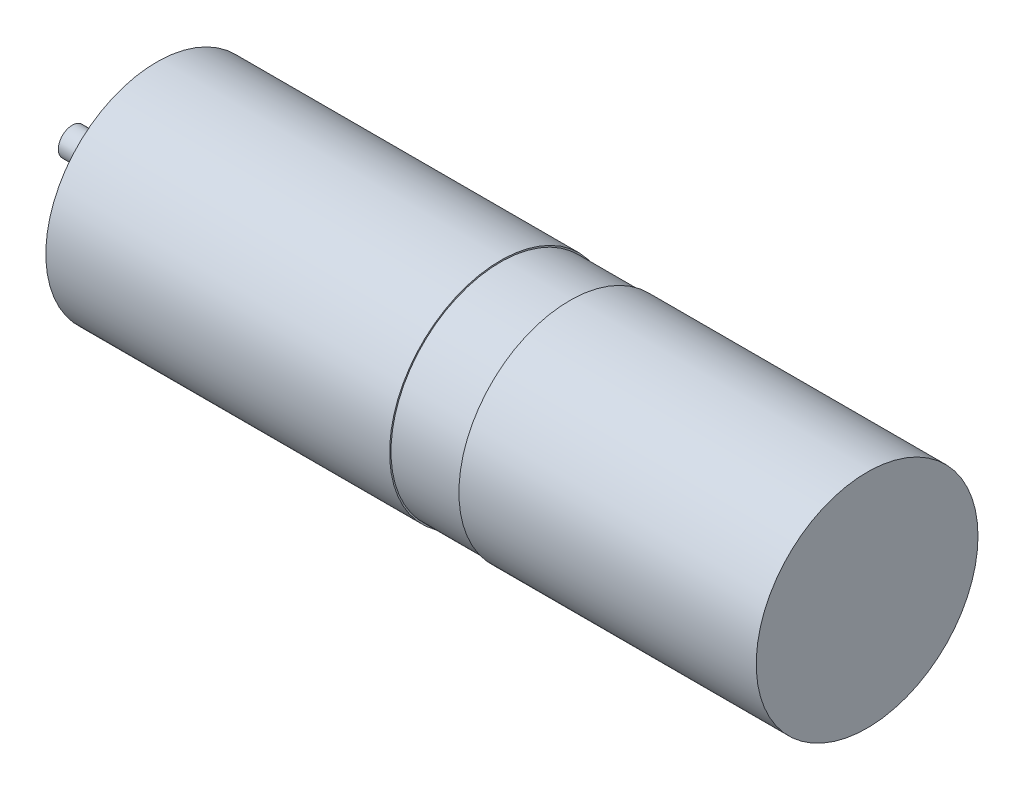
ISO-10303-21;
HEADER;
FILE_DESCRIPTION(('STEP AP214'),'2;1');
FILE_NAME('part.step','',(''),(''),'','','');
FILE_SCHEMA(('AUTOMOTIVE_DESIGN { 1 0 10303 214 1 1 1 1 }'));
ENDSEC;
DATA;
#1=APPLICATION_CONTEXT('core data for automotive mechanical design processes');
#2=APPLICATION_PROTOCOL_DEFINITION('international standard','automotive_design',2000,#1);
#3=PRODUCT_CONTEXT('',#1,'mechanical');
#4=PRODUCT('Part','Part','',(#3));
#5=PRODUCT_RELATED_PRODUCT_CATEGORY('part','',(#4));
#6=PRODUCT_DEFINITION_FORMATION('','',#4);
#7=PRODUCT_DEFINITION_CONTEXT('part definition',#1,'design');
#8=PRODUCT_DEFINITION('design','',#6,#7);
#9=PRODUCT_DEFINITION_SHAPE('','',#8);
#10=(LENGTH_UNIT() NAMED_UNIT(*) SI_UNIT(.MILLI.,.METRE.));
#11=(NAMED_UNIT(*) PLANE_ANGLE_UNIT() SI_UNIT($,.RADIAN.));
#12=(NAMED_UNIT(*) SI_UNIT($,.STERADIAN.) SOLID_ANGLE_UNIT());
#13=UNCERTAINTY_MEASURE_WITH_UNIT(LENGTH_MEASURE(1.E-05),#10,'distance_accuracy_value','');
#14=(GEOMETRIC_REPRESENTATION_CONTEXT(3) GLOBAL_UNCERTAINTY_ASSIGNED_CONTEXT((#13)) GLOBAL_UNIT_ASSIGNED_CONTEXT((#10,
#11,#12)) REPRESENTATION_CONTEXT('',''));
#15=CARTESIAN_POINT('',(0.,0.,0.));
#16=DIRECTION('',(0.,0.,1.));
#17=DIRECTION('',(1.,0.,0.));
#18=AXIS2_PLACEMENT_3D('',#15,#16,#17);
#19=CARTESIAN_POINT('',(0.,0.,0.));
#20=DIRECTION('',(1.,0.,0.));
#21=DIRECTION('',(0.,0.,-1.));
#22=AXIS2_PLACEMENT_3D('',#19,#20,#21);
#23=PLANE('',#22);
#24=CARTESIAN_POINT('',(0.,0.,0.));
#25=DIRECTION('',(1.,0.,0.));
#26=DIRECTION('',(0.,0.,-1.));
#27=AXIS2_PLACEMENT_3D('',#24,#25,#26);
#28=CIRCLE('',#27,1.);
#29=CARTESIAN_POINT('',(0.,0.,-1.));
#30=VERTEX_POINT('',#29);
#31=EDGE_CURVE('P0_E240',#30,#30,#28,.T.);
#32=ORIENTED_EDGE('',*,*,#31,.F.);
#33=EDGE_LOOP('',(#32));
#34=FACE_BOUND('',#33,.T.);
#35=ADVANCED_FACE('P0_F39',(#34),#23,.F.);
#36=CARTESIAN_POINT('',(0.,0.,0.));
#37=DIRECTION('',(1.,0.,0.));
#38=DIRECTION('',(0.,0.,-1.));
#39=AXIS2_PLACEMENT_3D('',#36,#37,#38);
#40=CYLINDRICAL_SURFACE('',#39,1.);
#41=CARTESIAN_POINT('',(5.1,0.,0.));
#42=DIRECTION('',(1.,0.,0.));
#43=DIRECTION('',(0.,0.,-1.));
#44=AXIS2_PLACEMENT_3D('',#41,#42,#43);
#45=CIRCLE('',#44,1.);
#46=CARTESIAN_POINT('',(5.1,0.,-1.));
#47=VERTEX_POINT('',#46);
#48=EDGE_CURVE('P0_E237',#47,#47,#45,.F.);
#49=ORIENTED_EDGE('',*,*,#48,.T.);
#50=EDGE_LOOP('',(#49));
#51=FACE_BOUND('',#50,.T.);
#52=ORIENTED_EDGE('',*,*,#31,.T.);
#53=EDGE_LOOP('',(#52));
#54=FACE_BOUND('',#53,.T.);
#55=ADVANCED_FACE('P0_F330',(#51,#54),#40,.T.);
#56=CARTESIAN_POINT('',(35.9,0.,0.));
#57=DIRECTION('',(1.,0.,0.));
#58=DIRECTION('',(0.,0.,-1.));
#59=AXIS2_PLACEMENT_3D('',#56,#57,#58);
#60=CYLINDRICAL_SURFACE('',#59,8.);
#61=CARTESIAN_POINT('',(35.9,0.,0.));
#62=DIRECTION('',(1.,0.,0.));
#63=DIRECTION('',(0.,0.,-1.));
#64=AXIS2_PLACEMENT_3D('',#61,#62,#63);
#65=CIRCLE('',#64,8.);
#66=CARTESIAN_POINT('',(35.9,0.,-8.));
#67=VERTEX_POINT('',#66);
#68=EDGE_CURVE('P0_E233',#67,#67,#65,.T.);
#69=ORIENTED_EDGE('',*,*,#68,.T.);
#70=EDGE_LOOP('',(#69));
#71=FACE_BOUND('',#70,.T.);
#72=CARTESIAN_POINT('',(57.35,0.,0.));
#73=DIRECTION('',(1.,0.,0.));
#74=DIRECTION('',(0.,0.,-1.));
#75=AXIS2_PLACEMENT_3D('',#72,#73,#74);
#76=CIRCLE('',#75,8.);
#77=CARTESIAN_POINT('',(57.35,0.,-8.));
#78=VERTEX_POINT('',#77);
#79=EDGE_CURVE('P0_E126',#78,#78,#76,.T.);
#80=ORIENTED_EDGE('',*,*,#79,.F.);
#81=EDGE_LOOP('',(#80));
#82=FACE_BOUND('',#81,.T.);
#83=ADVANCED_FACE('P0_F333',(#71,#82),#60,.T.);
#84=CARTESIAN_POINT('',(10.8999999999924,-2.75,4.763139720814));
#85=DIRECTION('',(-1.,0.,0.));
#86=DIRECTION('',(0.,0.,1.));
#87=AXIS2_PLACEMENT_3D('',#84,#85,#86);
#88=CONICAL_SURFACE('',#87,0.799999999862142,1.02974425822554);
#89=CARTESIAN_POINT('',(11.380688495251,-2.74999999999694,4.7631397208087));
#90=CARTESIAN_POINT('',(11.3606598079341,-2.73333334591309,4.7342722001009));
#91=CARTESIAN_POINT('',(11.3406311206297,-2.71666669025355,4.70540468029421));
#92=CARTESIAN_POINT('',(11.3005737460208,-2.68333337578107,4.64766964247959));
#93=CARTESIAN_POINT('',(11.2805450587164,-2.66666671696812,4.61880212447164));
#94=CARTESIAN_POINT('',(11.2404876840994,-2.63333339620072,4.56106709027509));
#95=CARTESIAN_POINT('',(11.2204589967869,-2.61666673424626,4.53219957408648));
#96=CARTESIAN_POINT('',(11.1804016221992,-2.5833334071974,4.47446454353132));
#97=CARTESIAN_POINT('',(11.1603729349239,-2.566666742103,4.44559702916475));
#98=CARTESIAN_POINT('',(11.1203155603228,-2.53333340878924,4.38786200227967));
#99=CARTESIAN_POINT('',(11.1002868729969,-2.5166667405699,4.35899448976114));
#100=CARTESIAN_POINT('',(11.0602294983783,-2.48333340094889,4.30125946647276));
#101=CARTESIAN_POINT('',(11.0402008110856,-2.46666672954722,4.2723919557029));
#102=CARTESIAN_POINT('',(11.00014343648,-2.43333338361549,4.21465693600522));
#103=CARTESIAN_POINT('',(10.9801147491671,-2.41666670908542,4.18578942707739));
#104=CARTESIAN_POINT('',(10.9400573745604,-2.38333335689083,4.1280544110533));
#105=CARTESIAN_POINT('',(10.9200286872665,-2.3666666792263,4.09918690395704));
#106=CARTESIAN_POINT('',(10.8999999999924,-2.34999999998386,4.07031939775804));
#107=B_SPLINE_CURVE_WITH_KNOTS('',3,(#89,#90,#91,#92,#93,#94,#95,#96,#97,#98,#99,#100,#101,#102,
#103,#104,#105,#106),.UNSPECIFIED.,.F.,.F.,(4,2,2,2,2,2,2,2,4),(0.,0.11666333970969,
0.233326679468105,0.34999001922652,0.466653358906935,0.583316698567902,0.699980038375045,
0.816643378133465,0.933306717813885),.UNSPECIFIED.);
#108=CARTESIAN_POINT('',(11.3806884952699,-2.75,4.76313972084986));
#109=VERTEX_POINT('',#108);
#110=CARTESIAN_POINT('',(10.8999999999968,-2.34999999999462,4.07031939777667));
#111=VERTEX_POINT('',#110);
#112=EDGE_CURVE('P0_E176',#109,#111,#107,.T.);
#113=ORIENTED_EDGE('',*,*,#112,.T.);
#114=CARTESIAN_POINT('',(10.8999999999981,-2.75,4.763139720814));
#115=DIRECTION('',(-1.,0.,0.));
#116=DIRECTION('',(0.,0.,1.));
#117=AXIS2_PLACEMENT_3D('',#114,#115,#116);
#118=CIRCLE('',#117,0.8000000000004);
#119=CARTESIAN_POINT('',(10.8999999999921,-3.15000000000122,5.45596004385373));
#120=VERTEX_POINT('',#119);
#121=EDGE_CURVE('P0_E236',#111,#120,#118,.T.);
#122=ORIENTED_EDGE('',*,*,#121,.T.);
#123=CARTESIAN_POINT('',(10.8999999999924,-3.15000000001198,5.45596004387236));
#124=CARTESIAN_POINT('',(10.9200286872665,-3.13333333334556,5.42709253041259));
#125=CARTESIAN_POINT('',(10.9400573745604,-3.11666666668508,5.39822501696314));
#126=CARTESIAN_POINT('',(10.9801147491671,-3.08333333335461,5.34048999004785));
#127=CARTESIAN_POINT('',(11.00014343648,-3.06666666668462,5.311622476582));
#128=CARTESIAN_POINT('',(11.0402008110856,-3.03333333332909,5.25388744962345));
#129=CARTESIAN_POINT('',(11.0602294983783,-3.01666666664355,5.22501993613074));
#130=CARTESIAN_POINT('',(11.1002868729969,-2.98333333331081,5.16728490921182));
#131=CARTESIAN_POINT('',(11.1203155603228,-2.96666666666361,5.13841739578561));
#132=CARTESIAN_POINT('',(11.1603729349239,-2.93333333335021,5.08068236890033));
#133=CARTESIAN_POINT('',(11.1804016221992,-2.916666666684,5.05181485544125));
#134=CARTESIAN_POINT('',(11.2204589967869,-2.88333333334756,4.99407982851622));
#135=CARTESIAN_POINT('',(11.2404876840994,-2.86666666667733,4.96521231505026));
#136=CARTESIAN_POINT('',(11.2805450587164,-2.83333333333442,4.90747728811418));
#137=CARTESIAN_POINT('',(11.3005737460208,-2.81666666666174,4.87860977464406));
#138=CARTESIAN_POINT('',(11.3406311206297,-2.78333333332583,4.82087474772023));
#139=CARTESIAN_POINT('',(11.3606598079341,-2.76666666666259,4.79200723426654));
#140=CARTESIAN_POINT('',(11.380688495251,-2.75000000000306,4.7631397208193));
#141=B_SPLINE_CURVE_WITH_KNOTS('',3,(#123,#124,#125,#126,#127,#128,#129,#130,#131,#132,#133,
#134,#135,#136,#137,#138,#139,#140),.UNSPECIFIED.,.F.,.F.,(4,2,2,2,2,2,2,2,4),(0.,
0.116663339680414,0.233326679438828,0.349990019245966,0.466653358906932,0.583316698587345,
0.69998003834576,0.816643378104174,0.933306717813864),.UNSPECIFIED.);
#142=EDGE_CURVE('P0_E197',#120,#109,#141,.T.);
#143=ORIENTED_EDGE('',*,*,#142,.T.);
#144=EDGE_LOOP('',(#113,#122,#143));
#145=FACE_BOUND('',#144,.T.);
#146=ADVANCED_FACE('P0_F348',(#145),#88,.F.);
#147=CARTESIAN_POINT('',(10.8999999999924,-2.75,4.763139720814));
#148=DIRECTION('',(-1.,0.,0.));
#149=DIRECTION('',(0.,0.,1.));
#150=AXIS2_PLACEMENT_3D('',#147,#148,#149);
#151=CONICAL_SURFACE('',#150,0.800000000032672,1.02974425865772);
#152=ORIENTED_EDGE('',*,*,#112,.F.);
#153=ORIENTED_EDGE('',*,*,#142,.F.);
#154=CARTESIAN_POINT('',(10.9,-2.75,4.763139720814));
#155=DIRECTION('',(-1.,0.,0.));
#156=DIRECTION('',(0.,0.,1.));
#157=AXIS2_PLACEMENT_3D('',#154,#155,#156);
#158=CIRCLE('',#157,0.8000000000004);
#159=EDGE_CURVE('P0_E148',#120,#111,#158,.T.);
#160=ORIENTED_EDGE('',*,*,#159,.T.);
#161=EDGE_LOOP('',(#152,#153,#160));
#162=FACE_BOUND('',#161,.T.);
#163=ADVANCED_FACE('P0_F186',(#162),#151,.F.);
#164=CARTESIAN_POINT('',(10.8999999999924,-2.75,-4.763139720814));
#165=DIRECTION('',(-1.,0.,0.));
#166=DIRECTION('',(0.,0.,1.));
#167=AXIS2_PLACEMENT_3D('',#164,#165,#166);
#168=CONICAL_SURFACE('',#167,0.799999999963599,1.02974425858824);
#169=CARTESIAN_POINT('',(10.8999999999355,-2.3500000000184,-4.07031939781786));
#170=CARTESIAN_POINT('',(10.9200286872676,-2.36666667927374,-4.0991869040392));
#171=CARTESIAN_POINT('',(10.9400573745922,-2.3833333569594,-4.12805441117207));
#172=CARTESIAN_POINT('',(10.9801147492222,-2.41666670917732,-4.18578942723657));
#173=CARTESIAN_POINT('',(11.0001434365278,-2.43333338370958,-4.21465693616818));
#174=CARTESIAN_POINT('',(11.0402008111213,-2.46666672961083,-4.27239195581306));
#175=CARTESIAN_POINT('',(11.0602294984092,-2.48333340097982,-4.30125946652633));
#176=CARTESIAN_POINT('',(11.1002868730262,-2.51666674060133,-4.35899448981558));
#177=CARTESIAN_POINT('',(11.1203155603552,-2.53333340885385,-4.38786200239157));
#178=CARTESIAN_POINT('',(11.1603729349885,-2.56666674220723,-4.44559702934529));
#179=CARTESIAN_POINT('',(11.1804016222927,-2.58333340730808,-4.47446454372302));
#180=CARTESIAN_POINT('',(11.2204589968856,-2.61666673434594,-4.53219957425913));
#181=CARTESIAN_POINT('',(11.2404876841742,-2.63333339628294,-4.5610670904175));
#182=CARTESIAN_POINT('',(11.2805450587905,-2.66666671704106,-4.61880212459798));
#183=CARTESIAN_POINT('',(11.3005737461182,-2.68333337586218,-4.64766964262008));
#184=CARTESIAN_POINT('',(11.3406311207547,-2.71666669035101,-4.70540468046302));
#185=CARTESIAN_POINT('',(11.3606598080634,-2.73333334601873,-4.73427220028386));
#186=CARTESIAN_POINT('',(11.3806884953647,-2.75000000011674,-4.76313972101621));
#187=B_SPLINE_CURVE_WITH_KNOTS('',3,(#169,#170,#171,#172,#173,#174,#175,#176,#177,#178,#179,
#180,#181,#182,#183,#184,#185,#186),.UNSPECIFIED.,.F.,.F.,(4,2,2,2,2,2,2,2,4),(0.,
0.116663339836422,0.233326679594841,0.349990019226534,0.466653359062952,0.583316698821367,
0.699980038453057,0.816643378289473,0.933306718047887),.UNSPECIFIED.);
#188=CARTESIAN_POINT('',(10.8999999999753,-2.35000000001226,-4.07031939780724));
#189=VERTEX_POINT('',#188);
#190=CARTESIAN_POINT('',(11.3806884953268,-2.75000000003619,-4.76313972080154));
#191=VERTEX_POINT('',#190);
#192=EDGE_CURVE('P0_E156',#189,#191,#187,.T.);
#193=ORIENTED_EDGE('',*,*,#192,.T.);
#194=DIRECTION('',(0.515038074941291,0.428583650350191,0.742328657680191));
#195=VECTOR('',#194,1.);
#196=CARTESIAN_POINT('',(-299815.206247926,-249500.368435099,-432147.314625292));
#197=LINE('',#196,#195);
#198=CARTESIAN_POINT('',(10.8999999999968,-3.14999999999766,-5.45596004383568));
#199=VERTEX_POINT('',#198);
#200=EDGE_CURVE('P0_E169',#199,#191,#197,.T.);
#201=ORIENTED_EDGE('',*,*,#200,.F.);
#202=CARTESIAN_POINT('',(10.8999999999981,-2.75,-4.763139720814));
#203=DIRECTION('',(-1.,0.,0.));
#204=DIRECTION('',(0.,0.,1.));
#205=AXIS2_PLACEMENT_3D('',#202,#203,#204);
#206=CIRCLE('',#205,0.8000000000004);
#207=EDGE_CURVE('P0_E146',#199,#189,#206,.T.);
#208=ORIENTED_EDGE('',*,*,#207,.T.);
#209=EDGE_LOOP('',(#193,#201,#208));
#210=FACE_BOUND('',#209,.T.);
#211=ADVANCED_FACE('P0_F185',(#210),#168,.F.);
#212=CARTESIAN_POINT('',(10.8999999999924,-2.75,-4.763139720814));
#213=DIRECTION('',(-1.,0.,0.));
#214=DIRECTION('',(0.,0.,1.));
#215=AXIS2_PLACEMENT_3D('',#212,#213,#214);
#216=CONICAL_SURFACE('',#215,0.799999999849912,1.02974425821204);
#217=ORIENTED_EDGE('',*,*,#192,.F.);
#218=CARTESIAN_POINT('',(10.8999999999981,-2.75,-4.763139720814));
#219=DIRECTION('',(-1.,0.,0.));
#220=DIRECTION('',(0.,0.,1.));
#221=AXIS2_PLACEMENT_3D('',#218,#219,#220);
#222=CIRCLE('',#221,0.8000000000004);
#223=EDGE_CURVE('P0_E145',#189,#199,#222,.T.);
#224=ORIENTED_EDGE('',*,*,#223,.T.);
#225=ORIENTED_EDGE('',*,*,#200,.T.);
#226=EDGE_LOOP('',(#217,#224,#225));
#227=FACE_BOUND('',#226,.T.);
#228=ADVANCED_FACE('P0_F164',(#227),#216,.F.);
#229=CARTESIAN_POINT('',(10.8999999999924,5.5,0.));
#230=DIRECTION('',(-1.,0.,0.));
#231=DIRECTION('',(0.,0.,1.));
#232=AXIS2_PLACEMENT_3D('',#229,#230,#231);
#233=CONICAL_SURFACE('',#232,0.800000000026557,1.02974425865772);
#234=CARTESIAN_POINT('',(11.380688495251,5.5,0.));
#235=VERTEX_POINT('',#234);
#236=VERTEX_LOOP('',#235);
#237=FACE_BOUND('',#236,.T.);
#238=CARTESIAN_POINT('',(10.9,5.5,0.));
#239=DIRECTION('',(-1.,0.,0.));
#240=DIRECTION('',(0.,0.,1.));
#241=AXIS2_PLACEMENT_3D('',#238,#239,#240);
#242=CIRCLE('',#241,0.8);
#243=CARTESIAN_POINT('',(10.9,5.5,0.8));
#244=VERTEX_POINT('',#243);
#245=EDGE_CURVE('P0_E141',#244,#244,#242,.T.);
#246=ORIENTED_EDGE('',*,*,#245,.T.);
#247=EDGE_LOOP('',(#246));
#248=FACE_BOUND('',#247,.T.);
#249=ADVANCED_FACE('P0_F162',(#237,#248),#233,.F.);
#250=CARTESIAN_POINT('',(5.1,0.,0.));
#251=DIRECTION('',(1.,0.,0.));
#252=DIRECTION('',(0.,0.,-1.));
#253=AXIS2_PLACEMENT_3D('',#250,#251,#252);
#254=PLANE('',#253);
#255=CARTESIAN_POINT('',(5.1,0.,0.));
#256=DIRECTION('',(1.,0.,0.));
#257=DIRECTION('',(0.,0.,-1.));
#258=AXIS2_PLACEMENT_3D('',#255,#256,#257);
#259=CIRCLE('',#258,4.5);
#260=CARTESIAN_POINT('',(5.1,0.,-4.5));
#261=VERTEX_POINT('',#260);
#262=EDGE_CURVE('P0_E144',#261,#261,#259,.T.);
#263=ORIENTED_EDGE('',*,*,#262,.F.);
#264=EDGE_LOOP('',(#263));
#265=FACE_BOUND('',#264,.T.);
#266=ORIENTED_EDGE('',*,*,#48,.F.);
#267=EDGE_LOOP('',(#266));
#268=FACE_BOUND('',#267,.T.);
#269=ADVANCED_FACE('P0_F318',(#265,#268),#254,.F.);
#270=CARTESIAN_POINT('',(35.9,0.,0.));
#271=DIRECTION('',(1.,0.,0.));
#272=DIRECTION('',(0.,0.,-1.));
#273=AXIS2_PLACEMENT_3D('',#270,#271,#272);
#274=PLANE('',#273);
#275=ORIENTED_EDGE('',*,*,#68,.F.);
#276=EDGE_LOOP('',(#275));
#277=FACE_BOUND('',#276,.T.);
#278=CARTESIAN_POINT('',(35.9,0.,0.));
#279=DIRECTION('',(1.,0.,0.));
#280=DIRECTION('',(0.,0.,-1.));
#281=AXIS2_PLACEMENT_3D('',#278,#279,#280);
#282=CIRCLE('',#281,7.9);
#283=CARTESIAN_POINT('',(35.9,0.,-7.9));
#284=VERTEX_POINT('',#283);
#285=EDGE_CURVE('P0_E228',#284,#284,#282,.F.);
#286=ORIENTED_EDGE('',*,*,#285,.F.);
#287=EDGE_LOOP('',(#286));
#288=FACE_BOUND('',#287,.T.);
#289=ADVANCED_FACE('P0_F315',(#277,#288),#274,.F.);
#290=CARTESIAN_POINT('',(10.9,-2.75,4.763139720814));
#291=DIRECTION('',(-1.,0.,0.));
#292=DIRECTION('',(0.,0.,1.));
#293=AXIS2_PLACEMENT_3D('',#290,#291,#292);
#294=CYLINDRICAL_SURFACE('',#293,0.8000000000004);
#295=CARTESIAN_POINT('',(6.1,-2.75,4.763139720814));
#296=DIRECTION('',(-1.,0.,0.));
#297=DIRECTION('',(0.,0.,1.));
#298=AXIS2_PLACEMENT_3D('',#295,#296,#297);
#299=CIRCLE('',#298,0.8000000000004);
#300=CARTESIAN_POINT('',(6.1,-2.75,5.5631397208144));
#301=VERTEX_POINT('',#300);
#302=EDGE_CURVE('P0_E225',#301,#301,#299,.T.);
#303=ORIENTED_EDGE('',*,*,#302,.T.);
#304=EDGE_LOOP('',(#303));
#305=FACE_BOUND('',#304,.T.);
#306=ORIENTED_EDGE('',*,*,#159,.F.);
#307=ORIENTED_EDGE('',*,*,#121,.F.);
#308=EDGE_LOOP('',(#306,#307));
#309=FACE_BOUND('',#308,.T.);
#310=ADVANCED_FACE('P0_F311',(#305,#309),#294,.F.);
#311=CARTESIAN_POINT('',(10.9,-2.75,-4.763139720814));
#312=DIRECTION('',(-1.,0.,0.));
#313=DIRECTION('',(0.,0.,1.));
#314=AXIS2_PLACEMENT_3D('',#311,#312,#313);
#315=CYLINDRICAL_SURFACE('',#314,0.8000000000004);
#316=CARTESIAN_POINT('',(6.1,-2.75,-4.763139720814));
#317=DIRECTION('',(-1.,0.,0.));
#318=DIRECTION('',(0.,0.,1.));
#319=AXIS2_PLACEMENT_3D('',#316,#317,#318);
#320=CIRCLE('',#319,0.8000000000004);
#321=CARTESIAN_POINT('',(6.1,-2.75,-3.9631397208136));
#322=VERTEX_POINT('',#321);
#323=EDGE_CURVE('P0_E222',#322,#322,#320,.T.);
#324=ORIENTED_EDGE('',*,*,#323,.T.);
#325=EDGE_LOOP('',(#324));
#326=FACE_BOUND('',#325,.T.);
#327=ORIENTED_EDGE('',*,*,#223,.F.);
#328=ORIENTED_EDGE('',*,*,#207,.F.);
#329=EDGE_LOOP('',(#327,#328));
#330=FACE_BOUND('',#329,.T.);
#331=ADVANCED_FACE('P0_F307',(#326,#330),#315,.F.);
#332=CARTESIAN_POINT('',(10.9,5.5,0.));
#333=DIRECTION('',(-1.,0.,0.));
#334=DIRECTION('',(0.,0.,1.));
#335=AXIS2_PLACEMENT_3D('',#332,#333,#334);
#336=CYLINDRICAL_SURFACE('',#335,0.8);
#337=CARTESIAN_POINT('',(6.1,5.5,0.));
#338=DIRECTION('',(-1.,0.,0.));
#339=DIRECTION('',(0.,0.,1.));
#340=AXIS2_PLACEMENT_3D('',#337,#338,#339);
#341=CIRCLE('',#340,0.8);
#342=CARTESIAN_POINT('',(6.1,5.5,0.8));
#343=VERTEX_POINT('',#342);
#344=EDGE_CURVE('P0_E219',#343,#343,#341,.T.);
#345=ORIENTED_EDGE('',*,*,#344,.T.);
#346=EDGE_LOOP('',(#345));
#347=FACE_BOUND('',#346,.T.);
#348=ORIENTED_EDGE('',*,*,#245,.F.);
#349=EDGE_LOOP('',(#348));
#350=FACE_BOUND('',#349,.T.);
#351=ADVANCED_FACE('P0_F303',(#347,#350),#336,.F.);
#352=CARTESIAN_POINT('',(5.1,0.,0.));
#353=DIRECTION('',(1.,0.,0.));
#354=DIRECTION('',(0.,0.,-1.));
#355=AXIS2_PLACEMENT_3D('',#352,#353,#354);
#356=CYLINDRICAL_SURFACE('',#355,4.5);
#357=CARTESIAN_POINT('',(6.1,0.,0.));
#358=DIRECTION('',(1.,0.,0.));
#359=DIRECTION('',(0.,0.,-1.));
#360=AXIS2_PLACEMENT_3D('',#357,#358,#359);
#361=CIRCLE('',#360,4.5);
#362=CARTESIAN_POINT('',(6.1,0.,-4.5));
#363=VERTEX_POINT('',#362);
#364=EDGE_CURVE('P0_E216',#363,#363,#361,.F.);
#365=ORIENTED_EDGE('',*,*,#364,.T.);
#366=EDGE_LOOP('',(#365));
#367=FACE_BOUND('',#366,.T.);
#368=ORIENTED_EDGE('',*,*,#262,.T.);
#369=EDGE_LOOP('',(#368));
#370=FACE_BOUND('',#369,.T.);
#371=ADVANCED_FACE('P0_F299',(#367,#370),#356,.T.);
#372=CARTESIAN_POINT('',(30.9,0.,0.));
#373=DIRECTION('',(1.,0.,0.));
#374=DIRECTION('',(0.,0.,-1.));
#375=AXIS2_PLACEMENT_3D('',#372,#373,#374);
#376=CYLINDRICAL_SURFACE('',#375,7.9);
#377=CARTESIAN_POINT('',(30.9,0.,0.));
#378=DIRECTION('',(1.,0.,0.));
#379=DIRECTION('',(0.,0.,-1.));
#380=AXIS2_PLACEMENT_3D('',#377,#378,#379);
#381=CIRCLE('',#380,7.9);
#382=CARTESIAN_POINT('',(30.9,0.,-7.9));
#383=VERTEX_POINT('',#382);
#384=EDGE_CURVE('P0_E213',#383,#383,#381,.F.);
#385=ORIENTED_EDGE('',*,*,#384,.F.);
#386=EDGE_LOOP('',(#385));
#387=FACE_BOUND('',#386,.T.);
#388=ORIENTED_EDGE('',*,*,#285,.T.);
#389=EDGE_LOOP('',(#388));
#390=FACE_BOUND('',#389,.T.);
#391=ADVANCED_FACE('P0_F295',(#387,#390),#376,.T.);
#392=CARTESIAN_POINT('',(6.1,0.,0.));
#393=DIRECTION('',(1.,0.,0.));
#394=DIRECTION('',(0.,0.,-1.));
#395=AXIS2_PLACEMENT_3D('',#392,#393,#394);
#396=PLANE('',#395);
#397=CARTESIAN_POINT('',(6.1,0.,0.));
#398=DIRECTION('',(1.,0.,0.));
#399=DIRECTION('',(0.,0.,-1.));
#400=AXIS2_PLACEMENT_3D('',#397,#398,#399);
#401=CIRCLE('',#400,8.);
#402=CARTESIAN_POINT('',(6.1,0.,-8.));
#403=VERTEX_POINT('',#402);
#404=EDGE_CURVE('P0_E49',#403,#403,#401,.T.);
#405=ORIENTED_EDGE('',*,*,#404,.F.);
#406=EDGE_LOOP('',(#405));
#407=FACE_BOUND('',#406,.T.);
#408=ORIENTED_EDGE('',*,*,#364,.F.);
#409=EDGE_LOOP('',(#408));
#410=FACE_BOUND('',#409,.T.);
#411=ORIENTED_EDGE('',*,*,#344,.F.);
#412=EDGE_LOOP('',(#411));
#413=FACE_BOUND('',#412,.T.);
#414=ORIENTED_EDGE('',*,*,#323,.F.);
#415=EDGE_LOOP('',(#414));
#416=FACE_BOUND('',#415,.T.);
#417=ORIENTED_EDGE('',*,*,#302,.F.);
#418=EDGE_LOOP('',(#417));
#419=FACE_BOUND('',#418,.T.);
#420=ADVANCED_FACE('P0_F291',(#407,#410,#413,#416,#419),#396,.F.);
#421=CARTESIAN_POINT('',(30.9,0.,0.));
#422=DIRECTION('',(1.,0.,0.));
#423=DIRECTION('',(0.,0.,-1.));
#424=AXIS2_PLACEMENT_3D('',#421,#422,#423);
#425=PLANE('',#424);
#426=CARTESIAN_POINT('',(30.9,0.,0.));
#427=DIRECTION('',(1.,0.,0.));
#428=DIRECTION('',(0.,0.,-1.));
#429=AXIS2_PLACEMENT_3D('',#426,#427,#428);
#430=CIRCLE('',#429,8.);
#431=CARTESIAN_POINT('',(30.9,0.,-8.));
#432=VERTEX_POINT('',#431);
#433=EDGE_CURVE('P0_E11',#432,#432,#430,.F.);
#434=ORIENTED_EDGE('',*,*,#433,.F.);
#435=EDGE_LOOP('',(#434));
#436=FACE_BOUND('',#435,.T.);
#437=ORIENTED_EDGE('',*,*,#384,.T.);
#438=EDGE_LOOP('',(#437));
#439=FACE_BOUND('',#438,.T.);
#440=ADVANCED_FACE('P0_F287',(#436,#439),#425,.T.);
#441=CARTESIAN_POINT('',(6.1,0.,0.));
#442=DIRECTION('',(1.,0.,0.));
#443=DIRECTION('',(0.,0.,-1.));
#444=AXIS2_PLACEMENT_3D('',#441,#442,#443);
#445=CYLINDRICAL_SURFACE('',#444,8.);
#446=ORIENTED_EDGE('',*,*,#433,.T.);
#447=EDGE_LOOP('',(#446));
#448=FACE_BOUND('',#447,.T.);
#449=ORIENTED_EDGE('',*,*,#404,.T.);
#450=EDGE_LOOP('',(#449));
#451=FACE_BOUND('',#450,.T.);
#452=ADVANCED_FACE('P0_F284',(#448,#451),#445,.T.);
#453=CARTESIAN_POINT('',(57.35,0.,0.));
#454=DIRECTION('',(1.,0.,0.));
#455=DIRECTION('',(0.,0.,-1.));
#456=AXIS2_PLACEMENT_3D('',#453,#454,#455);
#457=PLANE('',#456);
#458=ORIENTED_EDGE('',*,*,#79,.T.);
#459=EDGE_LOOP('',(#458));
#460=FACE_BOUND('',#459,.T.);
#461=ADVANCED_FACE('P0_F283',(#460),#457,.T.);
#462=CLOSED_SHELL('',(#35,#55,#83,#146,#163,#211,#228,#249,#269,#289,#310,#331,#351,#371,#391,
#420,#440,#452,#461));
#463=CARTESIAN_POINT('',(46.1,0.,0.));
#464=DIRECTION('',(1.,0.,0.));
#465=DIRECTION('',(0.,0.,-1.));
#466=AXIS2_PLACEMENT_3D('',#463,#464,#465);
#467=PLANE('',#466);
#468=CARTESIAN_POINT('',(46.1,-3.460254037844,5.));
#469=DIRECTION('',(1.,0.,0.));
#470=DIRECTION('',(0.,0.,-1.));
#471=AXIS2_PLACEMENT_3D('',#468,#469,#470);
#472=CIRCLE('',#471,0.7473009358649);
#473=CARTESIAN_POINT('',(46.1,-3.460254037844,4.2526990641351));
#474=VERTEX_POINT('',#473);
#475=EDGE_CURVE('P0_E138',#474,#474,#472,.F.);
#476=ORIENTED_EDGE('',*,*,#475,.F.);
#477=EDGE_LOOP('',(#476));
#478=FACE_BOUND('',#477,.T.);
#479=CARTESIAN_POINT('',(46.1,-4.549279121818,2.225209339563));
#480=DIRECTION('',(1.,0.,0.));
#481=DIRECTION('',(0.,0.,-1.));
#482=AXIS2_PLACEMENT_3D('',#479,#480,#481);
#483=CIRCLE('',#482,0.7473009358645);
#484=CARTESIAN_POINT('',(46.1,-4.549279121818,1.4779084036985));
#485=VERTEX_POINT('',#484);
#486=EDGE_CURVE('P0_E135',#485,#485,#483,.F.);
#487=ORIENTED_EDGE('',*,*,#486,.F.);
#488=EDGE_LOOP('',(#487));
#489=FACE_BOUND('',#488,.T.);
#490=CARTESIAN_POINT('',(46.1,-4.108737486442,3.653410243664));
#491=DIRECTION('',(1.,0.,0.));
#492=DIRECTION('',(0.,0.,-1.));
#493=AXIS2_PLACEMENT_3D('',#490,#491,#492);
#494=CIRCLE('',#493,0.747300935864);
#495=CARTESIAN_POINT('',(46.1,-4.108737486442,2.9061093078));
#496=VERTEX_POINT('',#495);
#497=EDGE_CURVE('P0_E123',#496,#496,#494,.F.);
#498=ORIENTED_EDGE('',*,*,#497,.F.);
#499=EDGE_LOOP('',(#498));
#500=FACE_BOUND('',#499,.T.);
#501=CARTESIAN_POINT('',(46.1,5.2,0.));
#502=DIRECTION('',(1.,0.,0.));
#503=DIRECTION('',(0.,0.,-1.));
#504=AXIS2_PLACEMENT_3D('',#501,#502,#503);
#505=CIRCLE('',#504,10.75);
#506=CARTESIAN_POINT('',(46.1,-4.1097730906827,-5.37500000000003));
#507=VERTEX_POINT('',#506);
#508=CARTESIAN_POINT('',(46.1,-4.10977309067786,5.37500000000841));
#509=VERTEX_POINT('',#508);
#510=EDGE_CURVE('P0_E110',#507,#509,#505,.F.);
#511=ORIENTED_EDGE('',*,*,#510,.T.);
#512=CARTESIAN_POINT('',(46.1,-3.460254037844,5.));
#513=DIRECTION('',(1.,0.,0.));
#514=DIRECTION('',(0.,0.,-1.));
#515=AXIS2_PLACEMENT_3D('',#512,#513,#514);
#516=CIRCLE('',#515,0.75);
#517=CARTESIAN_POINT('',(46.1,-2.810734985006,4.62500000000009));
#518=VERTEX_POINT('',#517);
#519=EDGE_CURVE('P0_E119',#509,#518,#516,.F.);
#520=ORIENTED_EDGE('',*,*,#519,.T.);
#521=CARTESIAN_POINT('',(46.1,5.2,0.));
#522=DIRECTION('',(1.,0.,0.));
#523=DIRECTION('',(0.,0.,-1.));
#524=AXIS2_PLACEMENT_3D('',#521,#522,#523);
#525=CIRCLE('',#524,9.25);
#526=CARTESIAN_POINT('',(46.1,-2.81073498500572,-4.62499999999992));
#527=VERTEX_POINT('',#526);
#528=EDGE_CURVE('P0_E57',#527,#518,#525,.F.);
#529=ORIENTED_EDGE('',*,*,#528,.F.);
#530=CARTESIAN_POINT('',(46.1,-3.460254037844,-5.));
#531=DIRECTION('',(1.,0.,0.));
#532=DIRECTION('',(0.,0.,-1.));
#533=AXIS2_PLACEMENT_3D('',#530,#531,#532);
#534=CIRCLE('',#533,0.75);
#535=EDGE_CURVE('P0_E65',#527,#507,#534,.F.);
#536=ORIENTED_EDGE('',*,*,#535,.T.);
#537=EDGE_LOOP('',(#511,#520,#529,#536));
#538=FACE_BOUND('',#537,.T.);
#539=ADVANCED_FACE('P0_F125',(#478,#489,#500,#538),#467,.F.);
#540=CARTESIAN_POINT('',(42.1,-4.128601785256,6.289882278576E-06));
#541=DIRECTION('',(1.,0.,0.));
#542=DIRECTION('',(0.,0.,-1.));
#543=AXIS2_PLACEMENT_3D('',#540,#541,#542);
#544=PLANE('',#543);
#545=CARTESIAN_POINT('',(42.1,5.2,0.));
#546=DIRECTION('',(1.,0.,0.));
#547=DIRECTION('',(0.,0.,-1.));
#548=AXIS2_PLACEMENT_3D('',#545,#546,#547);
#549=CIRCLE('',#548,9.25);
#550=CARTESIAN_POINT('',(42.1,-2.81073498500584,4.62500000000004));
#551=VERTEX_POINT('',#550);
#552=CARTESIAN_POINT('',(42.1,-2.81073498500584,-4.62500000000004));
#553=VERTEX_POINT('',#552);
#554=EDGE_CURVE('P0_E208',#551,#553,#549,.T.);
#555=ORIENTED_EDGE('',*,*,#554,.F.);
#556=CARTESIAN_POINT('',(42.1,-3.460254037844,5.));
#557=DIRECTION('',(1.,0.,0.));
#558=DIRECTION('',(0.,0.,-1.));
#559=AXIS2_PLACEMENT_3D('',#556,#557,#558);
#560=CIRCLE('',#559,0.75);
#561=CARTESIAN_POINT('',(42.1,-4.10977309068019,5.37500000000403));
#562=VERTEX_POINT('',#561);
#563=EDGE_CURVE('P0_E249',#551,#562,#560,.T.);
#564=ORIENTED_EDGE('',*,*,#563,.T.);
#565=CARTESIAN_POINT('',(42.1,5.2,0.));
#566=DIRECTION('',(1.,0.,0.));
#567=DIRECTION('',(0.,0.,-1.));
#568=AXIS2_PLACEMENT_3D('',#565,#566,#567);
#569=CIRCLE('',#568,10.75);
#570=CARTESIAN_POINT('',(42.1,-4.10977309068251,-5.37500000000002));
#571=VERTEX_POINT('',#570);
#572=EDGE_CURVE('P0_E112',#562,#571,#569,.T.);
#573=ORIENTED_EDGE('',*,*,#572,.T.);
#574=CARTESIAN_POINT('',(42.1,-3.460254037844,-5.));
#575=DIRECTION('',(1.,0.,0.));
#576=DIRECTION('',(0.,0.,-1.));
#577=AXIS2_PLACEMENT_3D('',#574,#575,#576);
#578=CIRCLE('',#577,0.75);
#579=EDGE_CURVE('P0_E205',#571,#553,#578,.T.);
#580=ORIENTED_EDGE('',*,*,#579,.T.);
#581=EDGE_LOOP('',(#555,#564,#573,#580));
#582=FACE_BOUND('',#581,.T.);
#583=ADVANCED_FACE('P0_F270',(#582),#544,.T.);
#584=CARTESIAN_POINT('',(42.1,5.2,0.));
#585=DIRECTION('',(1.,0.,0.));
#586=DIRECTION('',(0.,0.,-1.));
#587=AXIS2_PLACEMENT_3D('',#584,#585,#586);
#588=CYLINDRICAL_SURFACE('',#587,10.75);
#589=ORIENTED_EDGE('',*,*,#510,.F.);
#590=DIRECTION('',(1.,0.,0.));
#591=VECTOR('',#590,1.);
#592=CARTESIAN_POINT('',(42.1,-4.1097730906827,-5.37500000000003));
#593=LINE('',#592,#591);
#594=EDGE_CURVE('P0_E116',#571,#507,#593,.T.);
#595=ORIENTED_EDGE('',*,*,#594,.F.);
#596=ORIENTED_EDGE('',*,*,#572,.F.);
#597=DIRECTION('',(1.,0.,0.));
#598=VECTOR('',#597,1.);
#599=CARTESIAN_POINT('',(42.1,-4.10977309067807,5.37500000000805));
#600=LINE('',#599,#598);
#601=EDGE_CURVE('P0_E105',#509,#562,#600,.F.);
#602=ORIENTED_EDGE('',*,*,#601,.F.);
#603=EDGE_LOOP('',(#589,#595,#596,#602));
#604=FACE_BOUND('',#603,.T.);
#605=ADVANCED_FACE('P0_F107',(#604),#588,.F.);
#606=CARTESIAN_POINT('',(42.1,-3.460254037844,-5.));
#607=DIRECTION('',(1.,0.,0.));
#608=DIRECTION('',(0.,0.,-1.));
#609=AXIS2_PLACEMENT_3D('',#606,#607,#608);
#610=CYLINDRICAL_SURFACE('',#609,0.75);
#611=ORIENTED_EDGE('',*,*,#535,.F.);
#612=DIRECTION('',(1.,0.,0.));
#613=VECTOR('',#612,1.);
#614=CARTESIAN_POINT('',(42.1,-2.81073498500572,-4.62499999999992));
#615=LINE('',#614,#613);
#616=EDGE_CURVE('P0_E206',#553,#527,#615,.T.);
#617=ORIENTED_EDGE('',*,*,#616,.F.);
#618=ORIENTED_EDGE('',*,*,#579,.F.);
#619=ORIENTED_EDGE('',*,*,#594,.T.);
#620=EDGE_LOOP('',(#611,#617,#618,#619));
#621=FACE_BOUND('',#620,.T.);
#622=ADVANCED_FACE('P0_F467',(#621),#610,.F.);
#623=CARTESIAN_POINT('',(42.1,5.2,0.));
#624=DIRECTION('',(1.,0.,0.));
#625=DIRECTION('',(0.,0.,-1.));
#626=AXIS2_PLACEMENT_3D('',#623,#624,#625);
#627=CYLINDRICAL_SURFACE('',#626,9.25);
#628=ORIENTED_EDGE('',*,*,#616,.T.);
#629=ORIENTED_EDGE('',*,*,#528,.T.);
#630=DIRECTION('',(1.,0.,0.));
#631=VECTOR('',#630,1.);
#632=CARTESIAN_POINT('',(42.1,-2.810734985006,4.62500000000009));
#633=LINE('',#632,#631);
#634=EDGE_CURVE('P0_E121',#518,#551,#633,.F.);
#635=ORIENTED_EDGE('',*,*,#634,.T.);
#636=ORIENTED_EDGE('',*,*,#554,.T.);
#637=EDGE_LOOP('',(#628,#629,#635,#636));
#638=FACE_BOUND('',#637,.T.);
#639=ADVANCED_FACE('P0_F475',(#638),#627,.T.);
#640=CARTESIAN_POINT('',(42.1,-3.460254037844,5.));
#641=DIRECTION('',(1.,0.,0.));
#642=DIRECTION('',(0.,0.,-1.));
#643=AXIS2_PLACEMENT_3D('',#640,#641,#642);
#644=CYLINDRICAL_SURFACE('',#643,0.75);
#645=ORIENTED_EDGE('',*,*,#519,.F.);
#646=ORIENTED_EDGE('',*,*,#601,.T.);
#647=ORIENTED_EDGE('',*,*,#563,.F.);
#648=ORIENTED_EDGE('',*,*,#634,.F.);
#649=EDGE_LOOP('',(#645,#646,#647,#648));
#650=FACE_BOUND('',#649,.T.);
#651=ADVANCED_FACE('P0_F120',(#650),#644,.F.);
#652=CARTESIAN_POINT('',(45.1,-4.108737486442,3.653410243664));
#653=DIRECTION('',(1.,0.,0.));
#654=DIRECTION('',(0.,0.,-1.));
#655=AXIS2_PLACEMENT_3D('',#652,#653,#654);
#656=PLANE('',#655);
#657=CARTESIAN_POINT('',(45.1,-4.108737486442,3.653410243664));
#658=DIRECTION('',(1.,0.,0.));
#659=DIRECTION('',(0.,0.,-1.));
#660=AXIS2_PLACEMENT_3D('',#657,#658,#659);
#661=CIRCLE('',#660,0.747300935864);
#662=CARTESIAN_POINT('',(45.1,-4.108737486442,2.9061093078));
#663=VERTEX_POINT('',#662);
#664=EDGE_CURVE('P0_E209',#663,#663,#661,.T.);
#665=ORIENTED_EDGE('',*,*,#664,.F.);
#666=EDGE_LOOP('',(#665));
#667=FACE_BOUND('',#666,.T.);
#668=ADVANCED_FACE('P0_F436',(#667),#656,.F.);
#669=CARTESIAN_POINT('',(45.1,-4.108737486442,3.653410243664));
#670=DIRECTION('',(1.,0.,0.));
#671=DIRECTION('',(0.,0.,-1.));
#672=AXIS2_PLACEMENT_3D('',#669,#670,#671);
#673=CYLINDRICAL_SURFACE('',#672,0.747300935864);
#674=ORIENTED_EDGE('',*,*,#664,.T.);
#675=EDGE_LOOP('',(#674));
#676=FACE_BOUND('',#675,.T.);
#677=ORIENTED_EDGE('',*,*,#497,.T.);
#678=EDGE_LOOP('',(#677));
#679=FACE_BOUND('',#678,.T.);
#680=ADVANCED_FACE('P0_F440',(#676,#679),#673,.T.);
#681=CARTESIAN_POINT('',(45.1,-4.549279121818,2.225209339563));
#682=DIRECTION('',(1.,0.,0.));
#683=DIRECTION('',(0.,0.,-1.));
#684=AXIS2_PLACEMENT_3D('',#681,#682,#683);
#685=PLANE('',#684);
#686=CARTESIAN_POINT('',(45.1,-4.549279121818,2.225209339563));
#687=DIRECTION('',(1.,0.,0.));
#688=DIRECTION('',(0.,0.,-1.));
#689=AXIS2_PLACEMENT_3D('',#686,#687,#688);
#690=CIRCLE('',#689,0.7473009358645);
#691=CARTESIAN_POINT('',(45.1,-4.549279121818,1.4779084036985));
#692=VERTEX_POINT('',#691);
#693=EDGE_CURVE('P0_E250',#692,#692,#690,.T.);
#694=ORIENTED_EDGE('',*,*,#693,.F.);
#695=EDGE_LOOP('',(#694));
#696=FACE_BOUND('',#695,.T.);
#697=ADVANCED_FACE('P0_F267',(#696),#685,.F.);
#698=CARTESIAN_POINT('',(45.1,-4.549279121818,2.225209339563));
#699=DIRECTION('',(1.,0.,0.));
#700=DIRECTION('',(0.,0.,-1.));
#701=AXIS2_PLACEMENT_3D('',#698,#699,#700);
#702=CYLINDRICAL_SURFACE('',#701,0.7473009358645);
#703=ORIENTED_EDGE('',*,*,#693,.T.);
#704=EDGE_LOOP('',(#703));
#705=FACE_BOUND('',#704,.T.);
#706=ORIENTED_EDGE('',*,*,#486,.T.);
#707=EDGE_LOOP('',(#706));
#708=FACE_BOUND('',#707,.T.);
#709=ADVANCED_FACE('P0_F261',(#705,#708),#702,.T.);
#710=CARTESIAN_POINT('',(45.1,-3.460254037844,5.));
#711=DIRECTION('',(1.,0.,0.));
#712=DIRECTION('',(0.,0.,-1.));
#713=AXIS2_PLACEMENT_3D('',#710,#711,#712);
#714=PLANE('',#713);
#715=CARTESIAN_POINT('',(45.1,-3.460254037844,5.));
#716=DIRECTION('',(1.,0.,0.));
#717=DIRECTION('',(0.,0.,-1.));
#718=AXIS2_PLACEMENT_3D('',#715,#716,#717);
#719=CIRCLE('',#718,0.7473009358649);
#720=CARTESIAN_POINT('',(45.1,-3.460254037844,4.2526990641351));
#721=VERTEX_POINT('',#720);
#722=EDGE_CURVE('P0_E43',#721,#721,#719,.T.);
#723=ORIENTED_EDGE('',*,*,#722,.F.);
#724=EDGE_LOOP('',(#723));
#725=FACE_BOUND('',#724,.T.);
#726=ADVANCED_FACE('P0_F41',(#725),#714,.F.);
#727=CARTESIAN_POINT('',(45.1,-3.460254037844,5.));
#728=DIRECTION('',(1.,0.,0.));
#729=DIRECTION('',(0.,0.,-1.));
#730=AXIS2_PLACEMENT_3D('',#727,#728,#729);
#731=CYLINDRICAL_SURFACE('',#730,0.7473009358649);
#732=ORIENTED_EDGE('',*,*,#722,.T.);
#733=EDGE_LOOP('',(#732));
#734=FACE_BOUND('',#733,.T.);
#735=ORIENTED_EDGE('',*,*,#475,.T.);
#736=EDGE_LOOP('',(#735));
#737=FACE_BOUND('',#736,.T.);
#738=ADVANCED_FACE('P0_F257',(#734,#737),#731,.T.);
#739=CLOSED_SHELL('',(#539,#583,#605,#622,#639,#651,#668,#680,#697,#709,#726,#738));
#740=ORIENTED_CLOSED_SHELL('',*,#739,.T.);
#741=BREP_WITH_VOIDS('P0_B2',#462,(#740));
#742=CARTESIAN_POINT('',(9.94,5.49999999999999,2.27081684706087E-06));
#743=DIRECTION('',(1.,0.,0.));
#744=DIRECTION('',(0.,0.,-1.));
#745=AXIS2_PLACEMENT_3D('',#742,#743,#744);
#746=PLANE('',#745);
#747=CARTESIAN_POINT('',(9.94,5.5,0.));
#748=DIRECTION('',(-1.,0.,0.));
#749=DIRECTION('',(0.,0.,1.));
#750=AXIS2_PLACEMENT_3D('',#747,#748,#749);
#751=CIRCLE('',#750,1.);
#752=CARTESIAN_POINT('',(9.94,5.5,1.));
#753=VERTEX_POINT('',#752);
#754=EDGE_CURVE('P1_E18',#753,#753,#751,.T.);
#755=ORIENTED_EDGE('',*,*,#754,.F.);
#756=EDGE_LOOP('',(#755));
#757=FACE_BOUND('',#756,.T.);
#758=ADVANCED_FACE('P1_F15',(#757),#746,.T.);
#759=CARTESIAN_POINT('',(6.09999999999999,0.,0.));
#760=DIRECTION('',(-1.,0.,0.));
#761=DIRECTION('',(0.,0.,1.));
#762=AXIS2_PLACEMENT_3D('',#759,#760,#761);
#763=PLANE('',#762);
#764=CARTESIAN_POINT('',(6.09999999999999,5.5,0.));
#765=DIRECTION('',(-1.,0.,0.));
#766=DIRECTION('',(0.,0.,1.));
#767=AXIS2_PLACEMENT_3D('',#764,#765,#766);
#768=CIRCLE('',#767,1.);
#769=CARTESIAN_POINT('',(6.09999999999999,5.5,1.));
#770=VERTEX_POINT('',#769);
#771=EDGE_CURVE('P1_E10',#770,#770,#768,.F.);
#772=ORIENTED_EDGE('',*,*,#771,.F.);
#773=EDGE_LOOP('',(#772));
#774=FACE_BOUND('',#773,.T.);
#775=ADVANCED_FACE('P1_F30',(#774),#763,.T.);
#776=CARTESIAN_POINT('',(9.94,5.5,0.));
#777=DIRECTION('',(-1.,0.,0.));
#778=DIRECTION('',(0.,0.,1.));
#779=AXIS2_PLACEMENT_3D('',#776,#777,#778);
#780=CYLINDRICAL_SURFACE('',#779,1.);
#781=ORIENTED_EDGE('',*,*,#771,.T.);
#782=EDGE_LOOP('',(#781));
#783=FACE_BOUND('',#782,.T.);
#784=ORIENTED_EDGE('',*,*,#754,.T.);
#785=EDGE_LOOP('',(#784));
#786=FACE_BOUND('',#785,.T.);
#787=ADVANCED_FACE('P1_F27',(#783,#786),#780,.T.);
#788=CLOSED_SHELL('',(#758,#775,#787));
#789=MANIFOLD_SOLID_BREP('P1_B1',#788);
#790=CARTESIAN_POINT('',(9.93999999999999,-2.75,-4.763139720814));
#791=DIRECTION('',(1.,0.,0.));
#792=DIRECTION('',(0.,0.,-1.));
#793=AXIS2_PLACEMENT_3D('',#790,#791,#792);
#794=PLANE('',#793);
#795=CARTESIAN_POINT('',(9.93999999999999,-2.75,-4.763139720814));
#796=DIRECTION('',(-1.,0.,0.));
#797=DIRECTION('',(0.,0.,1.));
#798=AXIS2_PLACEMENT_3D('',#795,#796,#797);
#799=CIRCLE('',#798,1.);
#800=CARTESIAN_POINT('',(9.93999999999999,-2.75,-3.763139720814));
#801=VERTEX_POINT('',#800);
#802=EDGE_CURVE('P2_E19',#801,#801,#799,.T.);
#803=ORIENTED_EDGE('',*,*,#802,.F.);
#804=EDGE_LOOP('',(#803));
#805=FACE_BOUND('',#804,.T.);
#806=ADVANCED_FACE('P2_F16',(#805),#794,.T.);
#807=CARTESIAN_POINT('',(6.10000000000002,0.,0.));
#808=DIRECTION('',(-1.,0.,0.));
#809=DIRECTION('',(0.,-1.,0.));
#810=AXIS2_PLACEMENT_3D('',#807,#808,#809);
#811=PLANE('',#810);
#812=CARTESIAN_POINT('',(6.10000000000001,-2.75,-4.763139720814));
#813=DIRECTION('',(-1.,0.,0.));
#814=DIRECTION('',(0.,0.,1.));
#815=AXIS2_PLACEMENT_3D('',#812,#813,#814);
#816=CIRCLE('',#815,1.);
#817=CARTESIAN_POINT('',(6.10000000000001,-2.75,-3.763139720814));
#818=VERTEX_POINT('',#817);
#819=EDGE_CURVE('P2_E10',#818,#818,#816,.F.);
#820=ORIENTED_EDGE('',*,*,#819,.F.);
#821=EDGE_LOOP('',(#820));
#822=FACE_BOUND('',#821,.T.);
#823=ADVANCED_FACE('P2_F31',(#822),#811,.T.);
#824=CARTESIAN_POINT('',(9.93999999999999,-2.75,-4.763139720814));
#825=DIRECTION('',(-1.,0.,0.));
#826=DIRECTION('',(0.,0.,1.));
#827=AXIS2_PLACEMENT_3D('',#824,#825,#826);
#828=CYLINDRICAL_SURFACE('',#827,1.);
#829=ORIENTED_EDGE('',*,*,#819,.T.);
#830=EDGE_LOOP('',(#829));
#831=FACE_BOUND('',#830,.T.);
#832=ORIENTED_EDGE('',*,*,#802,.T.);
#833=EDGE_LOOP('',(#832));
#834=FACE_BOUND('',#833,.T.);
#835=ADVANCED_FACE('P2_F28',(#831,#834),#828,.T.);
#836=CLOSED_SHELL('',(#806,#823,#835));
#837=MANIFOLD_SOLID_BREP('P2_B1',#836);
#838=ADVANCED_BREP_SHAPE_REPRESENTATION('',(#18,#741,#789,#837),#14);
#839=SHAPE_DEFINITION_REPRESENTATION(#9,#838);
ENDSEC;
END-ISO-10303-21;
